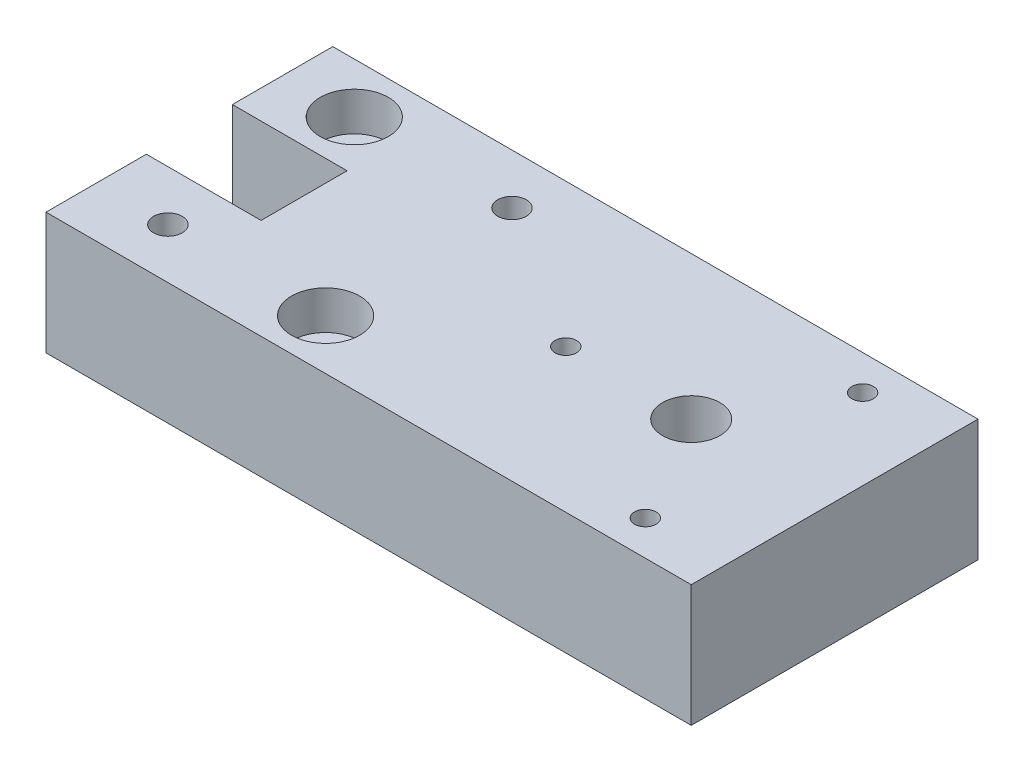
ISO-10303-21;
HEADER;
FILE_DESCRIPTION(('STEP AP214'),'2;1');
FILE_NAME('part.step','',(''),(''),'','','');
FILE_SCHEMA(('AUTOMOTIVE_DESIGN { 1 0 10303 214 1 1 1 1 }'));
ENDSEC;
DATA;
#1=APPLICATION_CONTEXT('core data for automotive mechanical design processes');
#2=APPLICATION_PROTOCOL_DEFINITION('international standard','automotive_design',2000,#1);
#3=PRODUCT_CONTEXT('',#1,'mechanical');
#4=PRODUCT('Part','Part','',(#3));
#5=PRODUCT_RELATED_PRODUCT_CATEGORY('part','',(#4));
#6=PRODUCT_DEFINITION_FORMATION('','',#4);
#7=PRODUCT_DEFINITION_CONTEXT('part definition',#1,'design');
#8=PRODUCT_DEFINITION('design','',#6,#7);
#9=PRODUCT_DEFINITION_SHAPE('','',#8);
#10=(LENGTH_UNIT() NAMED_UNIT(*) SI_UNIT(.MILLI.,.METRE.));
#11=(NAMED_UNIT(*) PLANE_ANGLE_UNIT() SI_UNIT($,.RADIAN.));
#12=(NAMED_UNIT(*) SI_UNIT($,.STERADIAN.) SOLID_ANGLE_UNIT());
#13=UNCERTAINTY_MEASURE_WITH_UNIT(LENGTH_MEASURE(1.E-05),#10,'distance_accuracy_value','');
#14=(GEOMETRIC_REPRESENTATION_CONTEXT(3) GLOBAL_UNCERTAINTY_ASSIGNED_CONTEXT((#13)) GLOBAL_UNIT_ASSIGNED_CONTEXT((#10,
#11,#12)) REPRESENTATION_CONTEXT('',''));
#15=CARTESIAN_POINT('',(0.,0.,0.));
#16=DIRECTION('',(0.,0.,1.));
#17=DIRECTION('',(1.,0.,0.));
#18=AXIS2_PLACEMENT_3D('',#15,#16,#17);
#19=CARTESIAN_POINT('',(-80.,17.,-13.));
#20=DIRECTION('',(0.,-1.,0.));
#21=DIRECTION('',(0.,0.,-1.));
#22=AXIS2_PLACEMENT_3D('',#19,#20,#21);
#23=CYLINDRICAL_SURFACE('',#22,2.75000000000001);
#24=CARTESIAN_POINT('',(-80.,0.,-13.));
#25=DIRECTION('',(0.,-1.,0.));
#26=DIRECTION('',(0.,0.,-1.));
#27=AXIS2_PLACEMENT_3D('',#24,#25,#26);
#28=CIRCLE('',#27,2.75000000000001);
#29=CARTESIAN_POINT('',(-80.,0.,-15.75));
#30=VERTEX_POINT('',#29);
#31=EDGE_CURVE('E150',#30,#30,#28,.T.);
#32=ORIENTED_EDGE('',*,*,#31,.T.);
#33=EDGE_LOOP('',(#32));
#34=FACE_BOUND('',#33,.T.);
#35=CARTESIAN_POINT('',(-80.,11.6,-13.));
#36=DIRECTION('',(0.,1.,0.));
#37=DIRECTION('',(0.,0.,1.));
#38=AXIS2_PLACEMENT_3D('',#35,#36,#37);
#39=CIRCLE('',#38,2.75000000000001);
#40=CARTESIAN_POINT('',(-80.,11.6,-10.25));
#41=VERTEX_POINT('',#40);
#42=EDGE_CURVE('E43',#41,#41,#39,.F.);
#43=ORIENTED_EDGE('',*,*,#42,.F.);
#44=EDGE_LOOP('',(#43));
#45=FACE_BOUND('',#44,.T.);
#46=ADVANCED_FACE('F39',(#34,#45),#23,.F.);
#47=CARTESIAN_POINT('',(-58.,17.,13.));
#48=DIRECTION('',(0.,-1.,0.));
#49=DIRECTION('',(0.,0.,-1.));
#50=AXIS2_PLACEMENT_3D('',#47,#48,#49);
#51=CYLINDRICAL_SURFACE('',#50,2.75);
#52=CARTESIAN_POINT('',(-58.,0.,13.));
#53=DIRECTION('',(0.,-1.,0.));
#54=DIRECTION('',(0.,0.,-1.));
#55=AXIS2_PLACEMENT_3D('',#52,#53,#54);
#56=CIRCLE('',#55,2.75);
#57=CARTESIAN_POINT('',(-58.,0.,10.25));
#58=VERTEX_POINT('',#57);
#59=EDGE_CURVE('E219',#58,#58,#56,.T.);
#60=ORIENTED_EDGE('',*,*,#59,.T.);
#61=EDGE_LOOP('',(#60));
#62=FACE_BOUND('',#61,.T.);
#63=CARTESIAN_POINT('',(-58.,11.6,13.));
#64=DIRECTION('',(0.,1.,0.));
#65=DIRECTION('',(0.,0.,1.));
#66=AXIS2_PLACEMENT_3D('',#63,#64,#65);
#67=CIRCLE('',#66,2.75);
#68=CARTESIAN_POINT('',(-58.,11.6,15.75));
#69=VERTEX_POINT('',#68);
#70=EDGE_CURVE('E185',#69,#69,#67,.F.);
#71=ORIENTED_EDGE('',*,*,#70,.F.);
#72=EDGE_LOOP('',(#71));
#73=FACE_BOUND('',#72,.T.);
#74=ADVANCED_FACE('F308',(#62,#73),#51,.F.);
#75=CARTESIAN_POINT('',(-90.,17.,-20.));
#76=DIRECTION('',(1.,0.,0.));
#77=DIRECTION('',(0.,0.,-1.));
#78=AXIS2_PLACEMENT_3D('',#75,#76,#77);
#79=PLANE('',#78);
#80=DIRECTION('',(0.,0.,1.));
#81=VECTOR('',#80,1.);
#82=CARTESIAN_POINT('',(-90.,0.,-20.));
#83=LINE('',#82,#81);
#84=CARTESIAN_POINT('',(-90.,0.,-20.));
#85=VERTEX_POINT('',#84);
#86=CARTESIAN_POINT('',(-90.,0.,-6.));
#87=VERTEX_POINT('',#86);
#88=EDGE_CURVE('E145',#85,#87,#83,.T.);
#89=ORIENTED_EDGE('',*,*,#88,.T.);
#90=DIRECTION('',(0.,-1.,0.));
#91=VECTOR('',#90,1.);
#92=CARTESIAN_POINT('',(-90.,17.,-6.));
#93=LINE('',#92,#91);
#94=CARTESIAN_POINT('',(-90.,17.,-6.));
#95=VERTEX_POINT('',#94);
#96=EDGE_CURVE('E11',#95,#87,#93,.T.);
#97=ORIENTED_EDGE('',*,*,#96,.F.);
#98=DIRECTION('',(0.,0.,1.));
#99=VECTOR('',#98,1.);
#100=CARTESIAN_POINT('',(-90.,17.,-20.));
#101=LINE('',#100,#99);
#102=CARTESIAN_POINT('',(-90.,17.,-20.));
#103=VERTEX_POINT('',#102);
#104=EDGE_CURVE('E168',#103,#95,#101,.T.);
#105=ORIENTED_EDGE('',*,*,#104,.F.);
#106=DIRECTION('',(0.,-1.,0.));
#107=VECTOR('',#106,1.);
#108=CARTESIAN_POINT('',(-90.,17.,-20.));
#109=LINE('',#108,#107);
#110=EDGE_CURVE('E141',#103,#85,#109,.T.);
#111=ORIENTED_EDGE('',*,*,#110,.T.);
#112=EDGE_LOOP('',(#89,#97,#105,#111));
#113=FACE_BOUND('',#112,.T.);
#114=ADVANCED_FACE('F41',(#113),#79,.F.);
#115=CARTESIAN_POINT('',(-90.,17.,-6.));
#116=DIRECTION('',(0.,0.,-1.));
#117=DIRECTION('',(-1.,0.,0.));
#118=AXIS2_PLACEMENT_3D('',#115,#116,#117);
#119=PLANE('',#118);
#120=DIRECTION('',(1.,0.,0.));
#121=VECTOR('',#120,1.);
#122=CARTESIAN_POINT('',(-90.,0.,-6.));
#123=LINE('',#122,#121);
#124=CARTESIAN_POINT('',(-74.,0.,-6.));
#125=VERTEX_POINT('',#124);
#126=EDGE_CURVE('E149',#87,#125,#123,.T.);
#127=ORIENTED_EDGE('',*,*,#126,.T.);
#128=DIRECTION('',(0.,-1.,0.));
#129=VECTOR('',#128,1.);
#130=CARTESIAN_POINT('',(-74.,17.,-6.));
#131=LINE('',#130,#129);
#132=CARTESIAN_POINT('',(-74.,17.,-6.));
#133=VERTEX_POINT('',#132);
#134=EDGE_CURVE('E50',#133,#125,#131,.T.);
#135=ORIENTED_EDGE('',*,*,#134,.F.);
#136=DIRECTION('',(1.,0.,0.));
#137=VECTOR('',#136,1.);
#138=CARTESIAN_POINT('',(-90.,17.,-6.));
#139=LINE('',#138,#137);
#140=EDGE_CURVE('E103',#95,#133,#139,.T.);
#141=ORIENTED_EDGE('',*,*,#140,.F.);
#142=ORIENTED_EDGE('',*,*,#96,.T.);
#143=EDGE_LOOP('',(#127,#135,#141,#142));
#144=FACE_BOUND('',#143,.T.);
#145=ADVANCED_FACE('F524',(#144),#119,.F.);
#146=CARTESIAN_POINT('',(-74.,17.,-6.));
#147=DIRECTION('',(1.,0.,0.));
#148=DIRECTION('',(0.,0.,-1.));
#149=AXIS2_PLACEMENT_3D('',#146,#147,#148);
#150=PLANE('',#149);
#151=CARTESIAN_POINT('',(-74.,12.,0.));
#152=DIRECTION('',(-1.,0.,0.));
#153=DIRECTION('',(0.,0.,1.));
#154=AXIS2_PLACEMENT_3D('',#151,#152,#153);
#155=CIRCLE('',#154,3.);
#156=CARTESIAN_POINT('',(-74.,12.,3.));
#157=VERTEX_POINT('',#156);
#158=EDGE_CURVE('E549',#157,#157,#155,.T.);
#159=ORIENTED_EDGE('',*,*,#158,.F.);
#160=EDGE_LOOP('',(#159));
#161=FACE_BOUND('',#160,.T.);
#162=DIRECTION('',(0.,0.,1.));
#163=VECTOR('',#162,1.);
#164=CARTESIAN_POINT('',(-74.,0.,-6.));
#165=LINE('',#164,#163);
#166=CARTESIAN_POINT('',(-74.,0.,6.));
#167=VERTEX_POINT('',#166);
#168=EDGE_CURVE('E153',#125,#167,#165,.T.);
#169=ORIENTED_EDGE('',*,*,#168,.T.);
#170=DIRECTION('',(0.,-1.,0.));
#171=VECTOR('',#170,1.);
#172=CARTESIAN_POINT('',(-74.,17.,6.));
#173=LINE('',#172,#171);
#174=CARTESIAN_POINT('',(-74.,17.,6.));
#175=VERTEX_POINT('',#174);
#176=EDGE_CURVE('E179',#175,#167,#173,.T.);
#177=ORIENTED_EDGE('',*,*,#176,.F.);
#178=DIRECTION('',(0.,0.,1.));
#179=VECTOR('',#178,1.);
#180=CARTESIAN_POINT('',(-74.,17.,-6.));
#181=LINE('',#180,#179);
#182=EDGE_CURVE('E273',#133,#175,#181,.T.);
#183=ORIENTED_EDGE('',*,*,#182,.F.);
#184=ORIENTED_EDGE('',*,*,#134,.T.);
#185=EDGE_LOOP('',(#169,#177,#183,#184));
#186=FACE_BOUND('',#185,.T.);
#187=ADVANCED_FACE('F516',(#161,#186),#150,.F.);
#188=CARTESIAN_POINT('',(-90.,17.,6.));
#189=DIRECTION('',(0.,0.,1.));
#190=DIRECTION('',(1.,0.,0.));
#191=AXIS2_PLACEMENT_3D('',#188,#189,#190);
#192=PLANE('',#191);
#193=DIRECTION('',(-1.,0.,0.));
#194=VECTOR('',#193,1.);
#195=CARTESIAN_POINT('',(-90.,0.,6.));
#196=LINE('',#195,#194);
#197=CARTESIAN_POINT('',(-90.,0.,6.));
#198=VERTEX_POINT('',#197);
#199=EDGE_CURVE('E156',#167,#198,#196,.T.);
#200=ORIENTED_EDGE('',*,*,#199,.T.);
#201=DIRECTION('',(0.,-1.,0.));
#202=VECTOR('',#201,1.);
#203=CARTESIAN_POINT('',(-90.,17.,6.));
#204=LINE('',#203,#202);
#205=CARTESIAN_POINT('',(-90.,17.,6.));
#206=VERTEX_POINT('',#205);
#207=EDGE_CURVE('E175',#206,#198,#204,.T.);
#208=ORIENTED_EDGE('',*,*,#207,.F.);
#209=DIRECTION('',(-1.,0.,0.));
#210=VECTOR('',#209,1.);
#211=CARTESIAN_POINT('',(-90.,17.,6.));
#212=LINE('',#211,#210);
#213=EDGE_CURVE('E276',#175,#206,#212,.T.);
#214=ORIENTED_EDGE('',*,*,#213,.F.);
#215=ORIENTED_EDGE('',*,*,#176,.T.);
#216=EDGE_LOOP('',(#200,#208,#214,#215));
#217=FACE_BOUND('',#216,.T.);
#218=ADVANCED_FACE('F284',(#217),#192,.F.);
#219=CARTESIAN_POINT('',(-90.,17.,6.));
#220=DIRECTION('',(1.,0.,0.));
#221=DIRECTION('',(0.,0.,-1.));
#222=AXIS2_PLACEMENT_3D('',#219,#220,#221);
#223=PLANE('',#222);
#224=DIRECTION('',(0.,0.,1.));
#225=VECTOR('',#224,1.);
#226=CARTESIAN_POINT('',(-90.,0.,6.));
#227=LINE('',#226,#225);
#228=CARTESIAN_POINT('',(-90.,0.,20.));
#229=VERTEX_POINT('',#228);
#230=EDGE_CURVE('E159',#198,#229,#227,.T.);
#231=ORIENTED_EDGE('',*,*,#230,.T.);
#232=DIRECTION('',(0.,-1.,0.));
#233=VECTOR('',#232,1.);
#234=CARTESIAN_POINT('',(-90.,17.,20.));
#235=LINE('',#234,#233);
#236=CARTESIAN_POINT('',(-90.,17.,20.));
#237=VERTEX_POINT('',#236);
#238=EDGE_CURVE('E134',#237,#229,#235,.T.);
#239=ORIENTED_EDGE('',*,*,#238,.F.);
#240=DIRECTION('',(0.,0.,1.));
#241=VECTOR('',#240,1.);
#242=CARTESIAN_POINT('',(-90.,17.,6.));
#243=LINE('',#242,#241);
#244=EDGE_CURVE('E123',#206,#237,#243,.T.);
#245=ORIENTED_EDGE('',*,*,#244,.F.);
#246=ORIENTED_EDGE('',*,*,#207,.T.);
#247=EDGE_LOOP('',(#231,#239,#245,#246));
#248=FACE_BOUND('',#247,.T.);
#249=ADVANCED_FACE('F288',(#248),#223,.F.);
#250=CARTESIAN_POINT('',(-90.,17.,20.));
#251=DIRECTION('',(0.,0.,-1.));
#252=DIRECTION('',(-1.,0.,0.));
#253=AXIS2_PLACEMENT_3D('',#250,#251,#252);
#254=PLANE('',#253);
#255=DIRECTION('',(1.,0.,0.));
#256=VECTOR('',#255,1.);
#257=CARTESIAN_POINT('',(-90.,0.,20.));
#258=LINE('',#257,#256);
#259=CARTESIAN_POINT('',(0.,0.,20.));
#260=VERTEX_POINT('',#259);
#261=EDGE_CURVE('E132',#229,#260,#258,.T.);
#262=ORIENTED_EDGE('',*,*,#261,.T.);
#263=DIRECTION('',(0.,-1.,0.));
#264=VECTOR('',#263,1.);
#265=CARTESIAN_POINT('',(0.,17.,20.));
#266=LINE('',#265,#264);
#267=CARTESIAN_POINT('',(0.,17.,20.));
#268=VERTEX_POINT('',#267);
#269=EDGE_CURVE('E129',#268,#260,#266,.T.);
#270=ORIENTED_EDGE('',*,*,#269,.F.);
#271=DIRECTION('',(1.,0.,0.));
#272=VECTOR('',#271,1.);
#273=CARTESIAN_POINT('',(-90.,17.,20.));
#274=LINE('',#273,#272);
#275=EDGE_CURVE('E117',#237,#268,#274,.T.);
#276=ORIENTED_EDGE('',*,*,#275,.F.);
#277=ORIENTED_EDGE('',*,*,#238,.T.);
#278=EDGE_LOOP('',(#262,#270,#276,#277));
#279=FACE_BOUND('',#278,.T.);
#280=ADVANCED_FACE('F130',(#279),#254,.F.);
#281=CARTESIAN_POINT('',(0.,17.,-20.));
#282=DIRECTION('',(-1.,0.,0.));
#283=DIRECTION('',(0.,0.,1.));
#284=AXIS2_PLACEMENT_3D('',#281,#282,#283);
#285=PLANE('',#284);
#286=DIRECTION('',(0.,0.,-1.));
#287=VECTOR('',#286,1.);
#288=CARTESIAN_POINT('',(0.,0.,-20.));
#289=LINE('',#288,#287);
#290=CARTESIAN_POINT('',(0.,0.,-20.));
#291=VERTEX_POINT('',#290);
#292=EDGE_CURVE('E89',#260,#291,#289,.T.);
#293=ORIENTED_EDGE('',*,*,#292,.T.);
#294=DIRECTION('',(0.,-1.,0.));
#295=VECTOR('',#294,1.);
#296=CARTESIAN_POINT('',(0.,17.,-20.));
#297=LINE('',#296,#295);
#298=CARTESIAN_POINT('',(0.,17.,-20.));
#299=VERTEX_POINT('',#298);
#300=EDGE_CURVE('E135',#299,#291,#297,.T.);
#301=ORIENTED_EDGE('',*,*,#300,.F.);
#302=DIRECTION('',(0.,0.,-1.));
#303=VECTOR('',#302,1.);
#304=CARTESIAN_POINT('',(0.,17.,-20.));
#305=LINE('',#304,#303);
#306=EDGE_CURVE('E121',#268,#299,#305,.T.);
#307=ORIENTED_EDGE('',*,*,#306,.F.);
#308=ORIENTED_EDGE('',*,*,#269,.T.);
#309=EDGE_LOOP('',(#293,#301,#307,#308));
#310=FACE_BOUND('',#309,.T.);
#311=ADVANCED_FACE('F137',(#310),#285,.F.);
#312=CARTESIAN_POINT('',(-90.,17.,-20.));
#313=DIRECTION('',(0.,0.,1.));
#314=DIRECTION('',(1.,0.,0.));
#315=AXIS2_PLACEMENT_3D('',#312,#313,#314);
#316=PLANE('',#315);
#317=DIRECTION('',(-1.,0.,0.));
#318=VECTOR('',#317,1.);
#319=CARTESIAN_POINT('',(-90.,0.,-20.));
#320=LINE('',#319,#318);
#321=EDGE_CURVE('E95',#291,#85,#320,.T.);
#322=ORIENTED_EDGE('',*,*,#321,.T.);
#323=ORIENTED_EDGE('',*,*,#110,.F.);
#324=DIRECTION('',(-1.,0.,0.));
#325=VECTOR('',#324,1.);
#326=CARTESIAN_POINT('',(-90.,17.,-20.));
#327=LINE('',#326,#325);
#328=EDGE_CURVE('E59',#299,#103,#327,.T.);
#329=ORIENTED_EDGE('',*,*,#328,.F.);
#330=ORIENTED_EDGE('',*,*,#300,.T.);
#331=EDGE_LOOP('',(#322,#323,#329,#330));
#332=FACE_BOUND('',#331,.T.);
#333=ADVANCED_FACE('F296',(#332),#316,.F.);
#334=CARTESIAN_POINT('',(0.,17.,0.));
#335=DIRECTION('',(0.,1.,0.));
#336=DIRECTION('',(0.,0.,1.));
#337=AXIS2_PLACEMENT_3D('',#334,#335,#336);
#338=PLANE('',#337);
#339=CARTESIAN_POINT('',(-80.,17.,-13.));
#340=DIRECTION('',(0.,1.,0.));
#341=DIRECTION('',(0.,0.,1.));
#342=AXIS2_PLACEMENT_3D('',#339,#340,#341);
#343=CIRCLE('',#342,4.75000000000001);
#344=CARTESIAN_POINT('',(-80.,17.,-8.25));
#345=VERTEX_POINT('',#344);
#346=EDGE_CURVE('E196',#345,#345,#343,.T.);
#347=ORIENTED_EDGE('',*,*,#346,.F.);
#348=EDGE_LOOP('',(#347));
#349=FACE_BOUND('',#348,.T.);
#350=CARTESIAN_POINT('',(-58.,17.,13.));
#351=DIRECTION('',(0.,1.,0.));
#352=DIRECTION('',(0.,0.,1.));
#353=AXIS2_PLACEMENT_3D('',#350,#351,#352);
#354=CIRCLE('',#353,4.75);
#355=CARTESIAN_POINT('',(-58.,17.,17.75));
#356=VERTEX_POINT('',#355);
#357=EDGE_CURVE('E211',#356,#356,#354,.T.);
#358=ORIENTED_EDGE('',*,*,#357,.F.);
#359=EDGE_LOOP('',(#358));
#360=FACE_BOUND('',#359,.T.);
#361=CARTESIAN_POINT('',(-58.,17.,-13.));
#362=DIRECTION('',(0.,-1.,0.));
#363=DIRECTION('',(0.,0.,-1.));
#364=AXIS2_PLACEMENT_3D('',#361,#362,#363);
#365=CIRCLE('',#364,2.);
#366=CARTESIAN_POINT('',(-58.,17.,-15.));
#367=VERTEX_POINT('',#366);
#368=EDGE_CURVE('E239',#367,#367,#365,.T.);
#369=ORIENTED_EDGE('',*,*,#368,.T.);
#370=EDGE_LOOP('',(#369));
#371=FACE_BOUND('',#370,.T.);
#372=CARTESIAN_POINT('',(-20.,17.,0.));
#373=DIRECTION('',(0.,-1.,0.));
#374=DIRECTION('',(0.,0.,-1.));
#375=AXIS2_PLACEMENT_3D('',#372,#373,#374);
#376=CIRCLE('',#375,4.);
#377=CARTESIAN_POINT('',(-20.,17.,-4.));
#378=VERTEX_POINT('',#377);
#379=EDGE_CURVE('E259',#378,#378,#376,.T.);
#380=ORIENTED_EDGE('',*,*,#379,.T.);
#381=EDGE_LOOP('',(#380));
#382=FACE_BOUND('',#381,.T.);
#383=CARTESIAN_POINT('',(-80.,17.,13.));
#384=DIRECTION('',(0.,-1.,0.));
#385=DIRECTION('',(0.,0.,-1.));
#386=AXIS2_PLACEMENT_3D('',#383,#384,#385);
#387=CIRCLE('',#386,2.);
#388=CARTESIAN_POINT('',(-80.,17.,11.));
#389=VERTEX_POINT('',#388);
#390=EDGE_CURVE('E251',#389,#389,#387,.T.);
#391=ORIENTED_EDGE('',*,*,#390,.T.);
#392=EDGE_LOOP('',(#391));
#393=FACE_BOUND('',#392,.T.);
#394=CARTESIAN_POINT('',(-11.25,17.,15.1554445662277));
#395=DIRECTION('',(0.,-1.,0.));
#396=DIRECTION('',(0.,0.,-1.));
#397=AXIS2_PLACEMENT_3D('',#394,#395,#396);
#398=CIRCLE('',#397,1.5);
#399=CARTESIAN_POINT('',(-11.25,17.,13.6554445662277));
#400=VERTEX_POINT('',#399);
#401=EDGE_CURVE('E215',#400,#400,#398,.T.);
#402=ORIENTED_EDGE('',*,*,#401,.T.);
#403=EDGE_LOOP('',(#402));
#404=FACE_BOUND('',#403,.T.);
#405=CARTESIAN_POINT('',(-11.2499999999992,17.,-15.1554445662277));
#406=DIRECTION('',(0.,-1.,0.));
#407=DIRECTION('',(0.,0.,-1.));
#408=AXIS2_PLACEMENT_3D('',#405,#406,#407);
#409=CIRCLE('',#408,1.5);
#410=CARTESIAN_POINT('',(-11.2499999999992,17.,-16.6554445662277));
#411=VERTEX_POINT('',#410);
#412=EDGE_CURVE('E224',#411,#411,#409,.T.);
#413=ORIENTED_EDGE('',*,*,#412,.T.);
#414=EDGE_LOOP('',(#413));
#415=FACE_BOUND('',#414,.T.);
#416=CARTESIAN_POINT('',(-37.5,17.,0.));
#417=DIRECTION('',(0.,-1.,0.));
#418=DIRECTION('',(0.,0.,-1.));
#419=AXIS2_PLACEMENT_3D('',#416,#417,#418);
#420=CIRCLE('',#419,1.49999999999929);
#421=CARTESIAN_POINT('',(-37.5,17.,-1.49999999999933));
#422=VERTEX_POINT('',#421);
#423=EDGE_CURVE('E232',#422,#422,#420,.T.);
#424=ORIENTED_EDGE('',*,*,#423,.T.);
#425=EDGE_LOOP('',(#424));
#426=FACE_BOUND('',#425,.T.);
#427=ORIENTED_EDGE('',*,*,#104,.T.);
#428=ORIENTED_EDGE('',*,*,#140,.T.);
#429=ORIENTED_EDGE('',*,*,#182,.T.);
#430=ORIENTED_EDGE('',*,*,#213,.T.);
#431=ORIENTED_EDGE('',*,*,#244,.T.);
#432=ORIENTED_EDGE('',*,*,#275,.T.);
#433=ORIENTED_EDGE('',*,*,#306,.T.);
#434=ORIENTED_EDGE('',*,*,#328,.T.);
#435=EDGE_LOOP('',(#427,#428,#429,#430,#431,#432,#433,#434));
#436=FACE_BOUND('',#435,.T.);
#437=ADVANCED_FACE('F119',(#349,#360,#371,#382,#393,#404,#415,#426,#436),#338,.T.);
#438=CARTESIAN_POINT('',(0.,0.,0.));
#439=DIRECTION('',(0.,1.,0.));
#440=DIRECTION('',(0.,0.,1.));
#441=AXIS2_PLACEMENT_3D('',#438,#439,#440);
#442=PLANE('',#441);
#443=ORIENTED_EDGE('',*,*,#59,.F.);
#444=EDGE_LOOP('',(#443));
#445=FACE_BOUND('',#444,.T.);
#446=CARTESIAN_POINT('',(-58.,0.,-13.));
#447=DIRECTION('',(0.,-1.,0.));
#448=DIRECTION('',(0.,0.,-1.));
#449=AXIS2_PLACEMENT_3D('',#446,#447,#448);
#450=CIRCLE('',#449,2.);
#451=CARTESIAN_POINT('',(-58.,0.,-15.));
#452=VERTEX_POINT('',#451);
#453=EDGE_CURVE('E244',#452,#452,#450,.T.);
#454=ORIENTED_EDGE('',*,*,#453,.F.);
#455=EDGE_LOOP('',(#454));
#456=FACE_BOUND('',#455,.T.);
#457=CARTESIAN_POINT('',(-20.,0.,0.));
#458=DIRECTION('',(0.,-1.,0.));
#459=DIRECTION('',(0.,0.,-1.));
#460=AXIS2_PLACEMENT_3D('',#457,#458,#459);
#461=CIRCLE('',#460,4.);
#462=CARTESIAN_POINT('',(-20.,0.,-4.));
#463=VERTEX_POINT('',#462);
#464=EDGE_CURVE('E243',#463,#463,#461,.T.);
#465=ORIENTED_EDGE('',*,*,#464,.F.);
#466=EDGE_LOOP('',(#465));
#467=FACE_BOUND('',#466,.T.);
#468=CARTESIAN_POINT('',(-80.,0.,13.));
#469=DIRECTION('',(0.,-1.,0.));
#470=DIRECTION('',(0.,0.,-1.));
#471=AXIS2_PLACEMENT_3D('',#468,#469,#470);
#472=CIRCLE('',#471,2.);
#473=CARTESIAN_POINT('',(-80.,0.,11.));
#474=VERTEX_POINT('',#473);
#475=EDGE_CURVE('E255',#474,#474,#472,.T.);
#476=ORIENTED_EDGE('',*,*,#475,.F.);
#477=EDGE_LOOP('',(#476));
#478=FACE_BOUND('',#477,.T.);
#479=CARTESIAN_POINT('',(-11.25,0.,15.1554445662277));
#480=DIRECTION('',(0.,-1.,0.));
#481=DIRECTION('',(0.,0.,-1.));
#482=AXIS2_PLACEMENT_3D('',#479,#480,#481);
#483=CIRCLE('',#482,1.5);
#484=CARTESIAN_POINT('',(-11.25,0.,13.6554445662277));
#485=VERTEX_POINT('',#484);
#486=EDGE_CURVE('E220',#485,#485,#483,.T.);
#487=ORIENTED_EDGE('',*,*,#486,.F.);
#488=EDGE_LOOP('',(#487));
#489=FACE_BOUND('',#488,.T.);
#490=CARTESIAN_POINT('',(-11.2499999999992,0.,-15.1554445662277));
#491=DIRECTION('',(0.,-1.,0.));
#492=DIRECTION('',(0.,0.,-1.));
#493=AXIS2_PLACEMENT_3D('',#490,#491,#492);
#494=CIRCLE('',#493,1.5);
#495=CARTESIAN_POINT('',(-11.2499999999992,0.,-16.6554445662277));
#496=VERTEX_POINT('',#495);
#497=EDGE_CURVE('E228',#496,#496,#494,.T.);
#498=ORIENTED_EDGE('',*,*,#497,.F.);
#499=EDGE_LOOP('',(#498));
#500=FACE_BOUND('',#499,.T.);
#501=CARTESIAN_POINT('',(-37.5,0.,0.));
#502=DIRECTION('',(0.,-1.,0.));
#503=DIRECTION('',(0.,0.,-1.));
#504=AXIS2_PLACEMENT_3D('',#501,#502,#503);
#505=CIRCLE('',#504,1.49999999999929);
#506=CARTESIAN_POINT('',(-37.5,0.,-1.49999999999933));
#507=VERTEX_POINT('',#506);
#508=EDGE_CURVE('E194',#507,#507,#505,.T.);
#509=ORIENTED_EDGE('',*,*,#508,.F.);
#510=EDGE_LOOP('',(#509));
#511=FACE_BOUND('',#510,.T.);
#512=ORIENTED_EDGE('',*,*,#31,.F.);
#513=EDGE_LOOP('',(#512));
#514=FACE_BOUND('',#513,.T.);
#515=ORIENTED_EDGE('',*,*,#88,.F.);
#516=ORIENTED_EDGE('',*,*,#321,.F.);
#517=ORIENTED_EDGE('',*,*,#292,.F.);
#518=ORIENTED_EDGE('',*,*,#261,.F.);
#519=ORIENTED_EDGE('',*,*,#230,.F.);
#520=ORIENTED_EDGE('',*,*,#199,.F.);
#521=ORIENTED_EDGE('',*,*,#168,.F.);
#522=ORIENTED_EDGE('',*,*,#126,.F.);
#523=EDGE_LOOP('',(#515,#516,#517,#518,#519,#520,#521,#522));
#524=FACE_BOUND('',#523,.T.);
#525=ADVANCED_FACE('F291',(#445,#456,#467,#478,#489,#500,#511,#514,#524),#442,.F.);
#526=CARTESIAN_POINT('',(-37.5,17.,0.));
#527=DIRECTION('',(0.,-1.,0.));
#528=DIRECTION('',(0.,0.,-1.));
#529=AXIS2_PLACEMENT_3D('',#526,#527,#528);
#530=CYLINDRICAL_SURFACE('',#529,1.49999999999929);
#531=ORIENTED_EDGE('',*,*,#423,.F.);
#532=EDGE_LOOP('',(#531));
#533=FACE_BOUND('',#532,.T.);
#534=ORIENTED_EDGE('',*,*,#508,.T.);
#535=EDGE_LOOP('',(#534));
#536=FACE_BOUND('',#535,.T.);
#537=ADVANCED_FACE('F321',(#533,#536),#530,.F.);
#538=CARTESIAN_POINT('',(-11.2499999999992,17.,-15.1554445662277));
#539=DIRECTION('',(0.,-1.,0.));
#540=DIRECTION('',(0.,0.,-1.));
#541=AXIS2_PLACEMENT_3D('',#538,#539,#540);
#542=CYLINDRICAL_SURFACE('',#541,1.5);
#543=ORIENTED_EDGE('',*,*,#412,.F.);
#544=EDGE_LOOP('',(#543));
#545=FACE_BOUND('',#544,.T.);
#546=ORIENTED_EDGE('',*,*,#497,.T.);
#547=EDGE_LOOP('',(#546));
#548=FACE_BOUND('',#547,.T.);
#549=ADVANCED_FACE('F326',(#545,#548),#542,.F.);
#550=CARTESIAN_POINT('',(-11.25,17.,15.1554445662277));
#551=DIRECTION('',(0.,-1.,0.));
#552=DIRECTION('',(0.,0.,-1.));
#553=AXIS2_PLACEMENT_3D('',#550,#551,#552);
#554=CYLINDRICAL_SURFACE('',#553,1.5);
#555=ORIENTED_EDGE('',*,*,#401,.F.);
#556=EDGE_LOOP('',(#555));
#557=FACE_BOUND('',#556,.T.);
#558=ORIENTED_EDGE('',*,*,#486,.T.);
#559=EDGE_LOOP('',(#558));
#560=FACE_BOUND('',#559,.T.);
#561=ADVANCED_FACE('F347',(#557,#560),#554,.F.);
#562=CARTESIAN_POINT('',(-80.,17.,13.));
#563=DIRECTION('',(0.,-1.,0.));
#564=DIRECTION('',(0.,0.,-1.));
#565=AXIS2_PLACEMENT_3D('',#562,#563,#564);
#566=CYLINDRICAL_SURFACE('',#565,2.);
#567=ORIENTED_EDGE('',*,*,#390,.F.);
#568=EDGE_LOOP('',(#567));
#569=FACE_BOUND('',#568,.T.);
#570=ORIENTED_EDGE('',*,*,#475,.T.);
#571=EDGE_LOOP('',(#570));
#572=FACE_BOUND('',#571,.T.);
#573=ADVANCED_FACE('F353',(#569,#572),#566,.F.);
#574=CARTESIAN_POINT('',(-20.,17.,0.));
#575=DIRECTION('',(0.,-1.,0.));
#576=DIRECTION('',(0.,0.,-1.));
#577=AXIS2_PLACEMENT_3D('',#574,#575,#576);
#578=CYLINDRICAL_SURFACE('',#577,4.);
#579=ORIENTED_EDGE('',*,*,#379,.F.);
#580=EDGE_LOOP('',(#579));
#581=FACE_BOUND('',#580,.T.);
#582=ORIENTED_EDGE('',*,*,#464,.T.);
#583=EDGE_LOOP('',(#582));
#584=FACE_BOUND('',#583,.T.);
#585=ADVANCED_FACE('F318',(#581,#584),#578,.F.);
#586=CARTESIAN_POINT('',(-58.,17.,-13.));
#587=DIRECTION('',(0.,-1.,0.));
#588=DIRECTION('',(0.,0.,-1.));
#589=AXIS2_PLACEMENT_3D('',#586,#587,#588);
#590=CYLINDRICAL_SURFACE('',#589,2.);
#591=ORIENTED_EDGE('',*,*,#368,.F.);
#592=EDGE_LOOP('',(#591));
#593=FACE_BOUND('',#592,.T.);
#594=ORIENTED_EDGE('',*,*,#453,.T.);
#595=EDGE_LOOP('',(#594));
#596=FACE_BOUND('',#595,.T.);
#597=ADVANCED_FACE('F359',(#593,#596),#590,.F.);
#598=CARTESIAN_POINT('',(-58.,11.6,13.));
#599=DIRECTION('',(0.,1.,0.));
#600=DIRECTION('',(0.,0.,1.));
#601=AXIS2_PLACEMENT_3D('',#598,#599,#600);
#602=PLANE('',#601);
#603=CARTESIAN_POINT('',(-58.,11.6,13.));
#604=DIRECTION('',(0.,1.,0.));
#605=DIRECTION('',(0.,0.,1.));
#606=AXIS2_PLACEMENT_3D('',#603,#604,#605);
#607=CIRCLE('',#606,4.75);
#608=CARTESIAN_POINT('',(-58.,11.6,17.75));
#609=VERTEX_POINT('',#608);
#610=EDGE_CURVE('E202',#609,#609,#607,.T.);
#611=ORIENTED_EDGE('',*,*,#610,.T.);
#612=EDGE_LOOP('',(#611));
#613=FACE_BOUND('',#612,.T.);
#614=ORIENTED_EDGE('',*,*,#70,.T.);
#615=EDGE_LOOP('',(#614));
#616=FACE_BOUND('',#615,.T.);
#617=ADVANCED_FACE('F361',(#613,#616),#602,.T.);
#618=CARTESIAN_POINT('',(-58.,11.6,13.));
#619=DIRECTION('',(0.,1.,0.));
#620=DIRECTION('',(0.,0.,1.));
#621=AXIS2_PLACEMENT_3D('',#618,#619,#620);
#622=CYLINDRICAL_SURFACE('',#621,4.75);
#623=ORIENTED_EDGE('',*,*,#610,.F.);
#624=EDGE_LOOP('',(#623));
#625=FACE_BOUND('',#624,.T.);
#626=ORIENTED_EDGE('',*,*,#357,.T.);
#627=EDGE_LOOP('',(#626));
#628=FACE_BOUND('',#627,.T.);
#629=ADVANCED_FACE('F393',(#625,#628),#622,.F.);
#630=CARTESIAN_POINT('',(-80.,11.6,-13.));
#631=DIRECTION('',(0.,1.,0.));
#632=DIRECTION('',(0.,0.,1.));
#633=AXIS2_PLACEMENT_3D('',#630,#631,#632);
#634=PLANE('',#633);
#635=CARTESIAN_POINT('',(-80.,11.6,-13.));
#636=DIRECTION('',(0.,1.,0.));
#637=DIRECTION('',(0.,0.,1.));
#638=AXIS2_PLACEMENT_3D('',#635,#636,#637);
#639=CIRCLE('',#638,4.75000000000001);
#640=CARTESIAN_POINT('',(-80.,11.6,-8.25));
#641=VERTEX_POINT('',#640);
#642=EDGE_CURVE('E188',#641,#641,#639,.T.);
#643=ORIENTED_EDGE('',*,*,#642,.T.);
#644=EDGE_LOOP('',(#643));
#645=FACE_BOUND('',#644,.T.);
#646=ORIENTED_EDGE('',*,*,#42,.T.);
#647=EDGE_LOOP('',(#646));
#648=FACE_BOUND('',#647,.T.);
#649=ADVANCED_FACE('F402',(#645,#648),#634,.T.);
#650=CARTESIAN_POINT('',(-80.,11.6,-13.));
#651=DIRECTION('',(0.,1.,0.));
#652=DIRECTION('',(0.,0.,1.));
#653=AXIS2_PLACEMENT_3D('',#650,#651,#652);
#654=CYLINDRICAL_SURFACE('',#653,4.75000000000001);
#655=ORIENTED_EDGE('',*,*,#642,.F.);
#656=EDGE_LOOP('',(#655));
#657=FACE_BOUND('',#656,.T.);
#658=ORIENTED_EDGE('',*,*,#346,.T.);
#659=EDGE_LOOP('',(#658));
#660=FACE_BOUND('',#659,.T.);
#661=ADVANCED_FACE('F409',(#657,#660),#654,.F.);
#662=CARTESIAN_POINT('',(-70.,12.,0.));
#663=DIRECTION('',(-1.,0.,0.));
#664=DIRECTION('',(0.,0.,1.));
#665=AXIS2_PLACEMENT_3D('',#662,#663,#664);
#666=CONICAL_SURFACE('',#665,3.,1.02974425867665);
#667=CARTESIAN_POINT('',(-68.1974181429173,12.,0.));
#668=VERTEX_POINT('',#667);
#669=VERTEX_LOOP('',#668);
#670=FACE_BOUND('',#669,.T.);
#671=CARTESIAN_POINT('',(-70.,12.,0.));
#672=DIRECTION('',(-1.,0.,0.));
#673=DIRECTION('',(0.,0.,1.));
#674=AXIS2_PLACEMENT_3D('',#671,#672,#673);
#675=CIRCLE('',#674,3.);
#676=CARTESIAN_POINT('',(-70.,12.,3.));
#677=VERTEX_POINT('',#676);
#678=EDGE_CURVE('E205',#677,#677,#675,.T.);
#679=ORIENTED_EDGE('',*,*,#678,.T.);
#680=EDGE_LOOP('',(#679));
#681=FACE_BOUND('',#680,.T.);
#682=ADVANCED_FACE('F416',(#670,#681),#666,.F.);
#683=CARTESIAN_POINT('',(-74.,12.,0.));
#684=DIRECTION('',(-1.,0.,0.));
#685=DIRECTION('',(0.,0.,1.));
#686=AXIS2_PLACEMENT_3D('',#683,#684,#685);
#687=CYLINDRICAL_SURFACE('',#686,3.);
#688=ORIENTED_EDGE('',*,*,#678,.F.);
#689=EDGE_LOOP('',(#688));
#690=FACE_BOUND('',#689,.T.);
#691=ORIENTED_EDGE('',*,*,#158,.T.);
#692=EDGE_LOOP('',(#691));
#693=FACE_BOUND('',#692,.T.);
#694=ADVANCED_FACE('F425',(#690,#693),#687,.F.);
#695=CLOSED_SHELL('',(#46,#74,#114,#145,#187,#218,#249,#280,#311,#333,#437,#525,#537,#549,#561,
#573,#585,#597,#617,#629,#649,#661,#682,#694));
#696=MANIFOLD_SOLID_BREP('B2',#695);
#697=ADVANCED_BREP_SHAPE_REPRESENTATION('',(#18,#696),#14);
#698=SHAPE_DEFINITION_REPRESENTATION(#9,#697);
ENDSEC;
END-ISO-10303-21;
